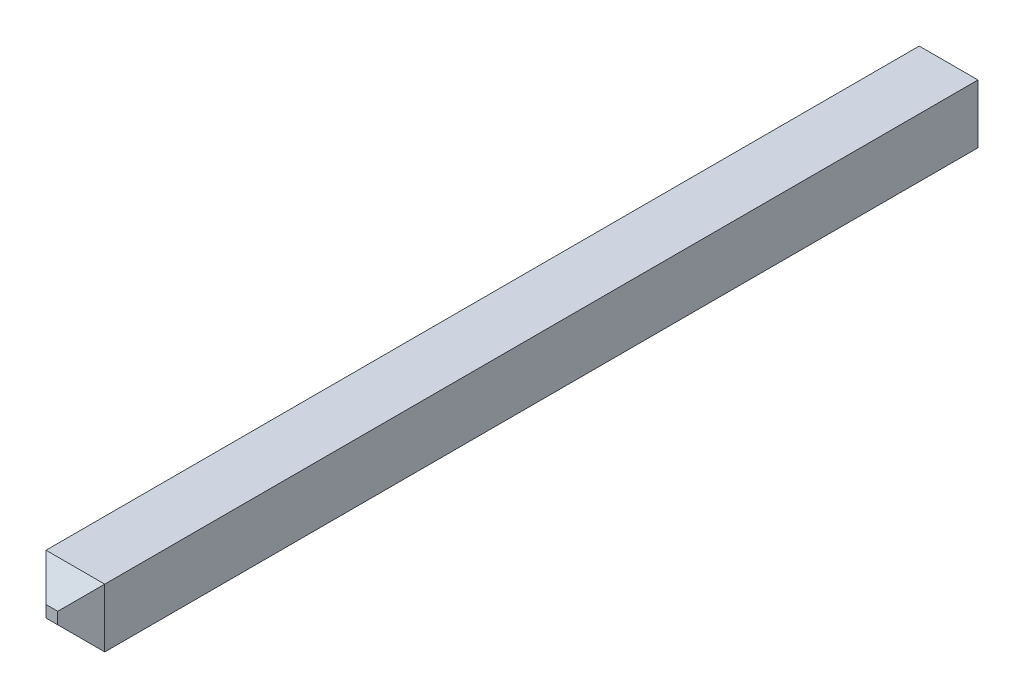
ISO-10303-21;
HEADER;
FILE_DESCRIPTION(('STEP AP214'),'2;1');
FILE_NAME('part.step','',(''),(''),'','','');
FILE_SCHEMA(('AUTOMOTIVE_DESIGN { 1 0 10303 214 1 1 1 1 }'));
ENDSEC;
DATA;
#1=APPLICATION_CONTEXT('core data for automotive mechanical design processes');
#2=APPLICATION_PROTOCOL_DEFINITION('international standard','automotive_design',2000,#1);
#3=PRODUCT_CONTEXT('',#1,'mechanical');
#4=PRODUCT('Part','Part','',(#3));
#5=PRODUCT_RELATED_PRODUCT_CATEGORY('part','',(#4));
#6=PRODUCT_DEFINITION_FORMATION('','',#4);
#7=PRODUCT_DEFINITION_CONTEXT('part definition',#1,'design');
#8=PRODUCT_DEFINITION('design','',#6,#7);
#9=PRODUCT_DEFINITION_SHAPE('','',#8);
#10=(LENGTH_UNIT() NAMED_UNIT(*) SI_UNIT(.MILLI.,.METRE.));
#11=(NAMED_UNIT(*) PLANE_ANGLE_UNIT() SI_UNIT($,.RADIAN.));
#12=(NAMED_UNIT(*) SI_UNIT($,.STERADIAN.) SOLID_ANGLE_UNIT());
#13=UNCERTAINTY_MEASURE_WITH_UNIT(LENGTH_MEASURE(1.E-05),#10,'distance_accuracy_value','');
#14=(GEOMETRIC_REPRESENTATION_CONTEXT(3) GLOBAL_UNCERTAINTY_ASSIGNED_CONTEXT((#13)) GLOBAL_UNIT_ASSIGNED_CONTEXT((#10,
#11,#12)) REPRESENTATION_CONTEXT('',''));
#15=CARTESIAN_POINT('',(0.,0.,0.));
#16=DIRECTION('',(0.,0.,1.));
#17=DIRECTION('',(1.,0.,0.));
#18=AXIS2_PLACEMENT_3D('',#15,#16,#17);
#19=CARTESIAN_POINT('',(0.731975872170932,-0.915257438330513,0.400189763779528));
#20=DIRECTION('',(0.,-0.707106781186544,-0.707106781186551));
#21=DIRECTION('',(0.,0.707106781186551,-0.707106781186544));
#22=AXIS2_PLACEMENT_3D('',#19,#20,#21);
#23=PLANE('',#22);
#24=DIRECTION('',(-1.,0.,0.));
#25=VECTOR('',#24,1.);
#26=CARTESIAN_POINT('',(0.712487683194554,-0.914666887149411,0.399599212598425));
#27=LINE('',#26,#25);
#28=CARTESIAN_POINT('',(0.712782958785105,-0.914666887149411,0.399599212598425));
#29=VERTEX_POINT('',#28);
#30=CARTESIAN_POINT('',(0.718688470596129,-0.914666887149411,0.399599212598425));
#31=VERTEX_POINT('',#30);
#32=EDGE_CURVE('E80',#29,#31,#27,.F.);
#33=ORIENTED_EDGE('',*,*,#32,.T.);
#34=DIRECTION('',(-0.577350269189628,-0.577350269189628,0.577350269189622));
#35=VECTOR('',#34,1.);
#36=CARTESIAN_POINT('',(0.730499494218177,-0.902855863527364,0.387788188976379));
#37=LINE('',#36,#35);
#38=CARTESIAN_POINT('',(0.730499494218176,-0.902855863527364,0.387788188976378));
#39=VERTEX_POINT('',#38);
#40=EDGE_CURVE('E20',#39,#31,#37,.T.);
#41=ORIENTED_EDGE('',*,*,#40,.F.);
#42=DIRECTION('',(1.,0.,0.));
#43=VECTOR('',#42,1.);
#44=CARTESIAN_POINT('',(0.699495557210302,-0.902855863527364,0.387788188976378));
#45=LINE('',#44,#43);
#46=CARTESIAN_POINT('',(0.700971935163058,-0.902855863527364,0.387788188976378));
#47=VERTEX_POINT('',#46);
#48=EDGE_CURVE('E107',#39,#47,#45,.F.);
#49=ORIENTED_EDGE('',*,*,#48,.T.);
#50=DIRECTION('',(-0.577350269189627,0.577350269189627,-0.577350269189624));
#51=VECTOR('',#50,1.);
#52=CARTESIAN_POINT('',(0.712782958785104,-0.914666887149411,0.399599212598426));
#53=LINE('',#52,#51);
#54=EDGE_CURVE('E86',#29,#47,#53,.T.);
#55=ORIENTED_EDGE('',*,*,#54,.F.);
#56=EDGE_LOOP('',(#33,#41,#49,#55));
#57=FACE_BOUND('',#56,.T.);
#58=ADVANCED_FACE('F17',(#57),#23,.F.);
#59=CARTESIAN_POINT('',(0.699495557210302,-0.902265312346261,-0.0505976377952755));
#60=DIRECTION('',(0.,0.707106781186552,-0.707106781186543));
#61=DIRECTION('',(0.,0.707106781186543,0.707106781186552));
#62=AXIS2_PLACEMENT_3D('',#59,#60,#61);
#63=PLANE('',#62);
#64=DIRECTION('',(-0.577350269189623,-0.577350269189623,-0.577350269189631));
#65=VECTOR('',#64,1.);
#66=CARTESIAN_POINT('',(0.730499494218176,-0.902855863527364,-0.0511881889763783));
#67=LINE('',#66,#65);
#68=CARTESIAN_POINT('',(0.730499494218176,-0.902855863527364,-0.0511881889763781));
#69=VERTEX_POINT('',#68);
#70=CARTESIAN_POINT('',(0.718688470596129,-0.914666887149411,-0.0629992125984255));
#71=VERTEX_POINT('',#70);
#72=EDGE_CURVE('E109',#69,#71,#67,.T.);
#73=ORIENTED_EDGE('',*,*,#72,.T.);
#74=DIRECTION('',(-1.,0.,0.));
#75=VECTOR('',#74,1.);
#76=CARTESIAN_POINT('',(0.712487683194554,-0.914666887149411,-0.0629992125984253));
#77=LINE('',#76,#75);
#78=CARTESIAN_POINT('',(0.712782958785105,-0.914666887149411,-0.0629992125984253));
#79=VERTEX_POINT('',#78);
#80=EDGE_CURVE('E114',#79,#71,#77,.F.);
#81=ORIENTED_EDGE('',*,*,#80,.F.);
#82=DIRECTION('',(-0.577350269189625,0.57735026918962,0.577350269189632));
#83=VECTOR('',#82,1.);
#84=CARTESIAN_POINT('',(0.712782958785105,-0.914666887149411,-0.062999212598425));
#85=LINE('',#84,#83);
#86=CARTESIAN_POINT('',(0.700971935163058,-0.902855863527364,-0.051188188976378));
#87=VERTEX_POINT('',#86);
#88=EDGE_CURVE('E117',#79,#87,#85,.T.);
#89=ORIENTED_EDGE('',*,*,#88,.T.);
#90=DIRECTION('',(1.,0.,0.));
#91=VECTOR('',#90,1.);
#92=CARTESIAN_POINT('',(0.699495557210302,-0.902855863527364,-0.0511881889763779));
#93=LINE('',#92,#91);
#94=EDGE_CURVE('E105',#87,#69,#93,.T.);
#95=ORIENTED_EDGE('',*,*,#94,.T.);
#96=EDGE_LOOP('',(#73,#81,#89,#95));
#97=FACE_BOUND('',#96,.T.);
#98=ADVANCED_FACE('F175',(#97),#63,.T.);
#99=CARTESIAN_POINT('',(0.718097919415027,-0.901379485574608,0.400189763779528));
#100=DIRECTION('',(0.707106781186544,0.,0.707106781186551));
#101=DIRECTION('',(0.707106781186551,0.,-0.707106781186544));
#102=AXIS2_PLACEMENT_3D('',#99,#100,#101);
#103=PLANE('',#102);
#104=DIRECTION('',(0.,1.,0.));
#105=VECTOR('',#104,1.);
#106=CARTESIAN_POINT('',(0.730499494218176,-0.933859800535238,0.387788188976378));
#107=LINE('',#106,#105);
#108=CARTESIAN_POINT('',(0.730499494218176,-0.932383422582482,0.387788188976378));
#109=VERTEX_POINT('',#108);
#110=EDGE_CURVE('E94',#39,#109,#107,.F.);
#111=ORIENTED_EDGE('',*,*,#110,.F.);
#112=ORIENTED_EDGE('',*,*,#40,.T.);
#113=DIRECTION('',(0.,1.,0.));
#114=VECTOR('',#113,1.);
#115=CARTESIAN_POINT('',(0.718688470596129,-0.91437161155886,0.399599212598425));
#116=LINE('',#115,#114);
#117=CARTESIAN_POINT('',(0.718688470596129,-0.920572398960434,0.399599212598425));
#118=VERTEX_POINT('',#117);
#119=EDGE_CURVE('E88',#31,#118,#116,.F.);
#120=ORIENTED_EDGE('',*,*,#119,.T.);
#121=DIRECTION('',(-0.577350269189606,0.577350269189638,0.577350269189633));
#122=VECTOR('',#121,1.);
#123=CARTESIAN_POINT('',(0.730499494218176,-0.932383422582482,0.387788188976378));
#124=LINE('',#123,#122);
#125=EDGE_CURVE('E131',#109,#118,#124,.T.);
#126=ORIENTED_EDGE('',*,*,#125,.F.);
#127=EDGE_LOOP('',(#111,#112,#120,#126));
#128=FACE_BOUND('',#127,.T.);
#129=ADVANCED_FACE('F91',(#128),#103,.T.);
#130=CARTESIAN_POINT('',(0.712487683194554,-0.91437161155886,0.399599212598425));
#131=DIRECTION('',(0.,0.,-1.));
#132=DIRECTION('',(-1.,0.,0.));
#133=AXIS2_PLACEMENT_3D('',#130,#131,#132);
#134=PLANE('',#133);
#135=DIRECTION('',(1.,0.,0.));
#136=VECTOR('',#135,1.);
#137=CARTESIAN_POINT('',(0.731975872170932,-0.920572398960435,0.399599212598426));
#138=LINE('',#137,#136);
#139=CARTESIAN_POINT('',(0.712782958785105,-0.920572398960434,0.399599212598425));
#140=VERTEX_POINT('',#139);
#141=EDGE_CURVE('E98',#118,#140,#138,.F.);
#142=ORIENTED_EDGE('',*,*,#141,.F.);
#143=ORIENTED_EDGE('',*,*,#119,.F.);
#144=ORIENTED_EDGE('',*,*,#32,.F.);
#145=DIRECTION('',(0.,1.,0.));
#146=VECTOR('',#145,1.);
#147=CARTESIAN_POINT('',(0.712782958785104,-0.933859800535238,0.399599212598426));
#148=LINE('',#147,#146);
#149=EDGE_CURVE('E100',#140,#29,#148,.T.);
#150=ORIENTED_EDGE('',*,*,#149,.F.);
#151=EDGE_LOOP('',(#142,#143,#144,#150));
#152=FACE_BOUND('',#151,.T.);
#153=ADVANCED_FACE('F96',(#152),#134,.F.);
#154=CARTESIAN_POINT('',(0.713373509966207,-0.933859800535238,0.400189763779528));
#155=DIRECTION('',(-0.707106781186544,0.,0.707106781186551));
#156=DIRECTION('',(0.707106781186551,0.,0.707106781186544));
#157=AXIS2_PLACEMENT_3D('',#154,#155,#156);
#158=PLANE('',#157);
#159=ORIENTED_EDGE('',*,*,#149,.T.);
#160=ORIENTED_EDGE('',*,*,#54,.T.);
#161=DIRECTION('',(0.,1.,0.));
#162=VECTOR('',#161,1.);
#163=CARTESIAN_POINT('',(0.700971935163058,-0.901379485574608,0.387788188976378));
#164=LINE('',#163,#162);
#165=CARTESIAN_POINT('',(0.700971935163058,-0.932383422582482,0.387788188976378));
#166=VERTEX_POINT('',#165);
#167=EDGE_CURVE('E134',#166,#47,#164,.T.);
#168=ORIENTED_EDGE('',*,*,#167,.F.);
#169=DIRECTION('',(-0.57735026918961,-0.577350269189636,-0.577350269189631));
#170=VECTOR('',#169,1.);
#171=CARTESIAN_POINT('',(0.712782958785105,-0.920572398960435,0.399599212598426));
#172=LINE('',#171,#170);
#173=EDGE_CURVE('E128',#140,#166,#172,.T.);
#174=ORIENTED_EDGE('',*,*,#173,.F.);
#175=EDGE_LOOP('',(#159,#160,#168,#174));
#176=FACE_BOUND('',#175,.T.);
#177=ADVANCED_FACE('F184',(#176),#158,.T.);
#178=CARTESIAN_POINT('',(0.699495557210302,-0.902855863527364,0.152158267716535));
#179=DIRECTION('',(0.,-1.,0.));
#180=DIRECTION('',(0.,0.,-1.));
#181=AXIS2_PLACEMENT_3D('',#178,#179,#180);
#182=PLANE('',#181);
#183=ORIENTED_EDGE('',*,*,#48,.F.);
#184=DIRECTION('',(0.,0.,-1.));
#185=VECTOR('',#184,1.);
#186=CARTESIAN_POINT('',(0.730499494218176,-0.902855863527364,0.152158267716535));
#187=LINE('',#186,#185);
#188=EDGE_CURVE('E122',#69,#39,#187,.F.);
#189=ORIENTED_EDGE('',*,*,#188,.F.);
#190=ORIENTED_EDGE('',*,*,#94,.F.);
#191=DIRECTION('',(0.,0.,1.));
#192=VECTOR('',#191,1.);
#193=CARTESIAN_POINT('',(0.700971935163058,-0.902855863527364,0.152158267716535));
#194=LINE('',#193,#192);
#195=EDGE_CURVE('E137',#47,#87,#194,.F.);
#196=ORIENTED_EDGE('',*,*,#195,.F.);
#197=EDGE_LOOP('',(#183,#189,#190,#196));
#198=FACE_BOUND('',#197,.T.);
#199=ADVANCED_FACE('F186',(#198),#182,.F.);
#200=CARTESIAN_POINT('',(0.731090045399279,-0.933859800535238,-0.0505976377952755));
#201=DIRECTION('',(-0.707106781186552,0.,0.707106781186543));
#202=DIRECTION('',(0.707106781186543,0.,0.707106781186552));
#203=AXIS2_PLACEMENT_3D('',#200,#201,#202);
#204=PLANE('',#203);
#205=DIRECTION('',(-0.577350269189602,0.577350269189634,-0.577350269189642));
#206=VECTOR('',#205,1.);
#207=CARTESIAN_POINT('',(0.730499494218176,-0.932383422582482,-0.0511881889763777));
#208=LINE('',#207,#206);
#209=CARTESIAN_POINT('',(0.730499494218176,-0.932383422582482,-0.0511881889763781));
#210=VERTEX_POINT('',#209);
#211=CARTESIAN_POINT('',(0.718688470596129,-0.920572398960434,-0.0629992125984255));
#212=VERTEX_POINT('',#211);
#213=EDGE_CURVE('E142',#210,#212,#208,.T.);
#214=ORIENTED_EDGE('',*,*,#213,.T.);
#215=DIRECTION('',(0.,1.,0.));
#216=VECTOR('',#215,1.);
#217=CARTESIAN_POINT('',(0.718688470596129,-0.91437161155886,-0.0629992125984253));
#218=LINE('',#217,#216);
#219=EDGE_CURVE('E111',#71,#212,#218,.F.);
#220=ORIENTED_EDGE('',*,*,#219,.F.);
#221=ORIENTED_EDGE('',*,*,#72,.F.);
#222=DIRECTION('',(0.,1.,0.));
#223=VECTOR('',#222,1.);
#224=CARTESIAN_POINT('',(0.730499494218176,-0.933859800535238,-0.0511881889763779));
#225=LINE('',#224,#223);
#226=EDGE_CURVE('E125',#210,#69,#225,.T.);
#227=ORIENTED_EDGE('',*,*,#226,.F.);
#228=EDGE_LOOP('',(#214,#220,#221,#227));
#229=FACE_BOUND('',#228,.T.);
#230=ADVANCED_FACE('F169',(#229),#204,.F.);
#231=CARTESIAN_POINT('',(0.712487683194554,-0.91437161155886,-0.0629992125984253));
#232=DIRECTION('',(0.,0.,-1.));
#233=DIRECTION('',(-1.,0.,0.));
#234=AXIS2_PLACEMENT_3D('',#231,#232,#233);
#235=PLANE('',#234);
#236=DIRECTION('',(0.,1.,0.));
#237=VECTOR('',#236,1.);
#238=CARTESIAN_POINT('',(0.712782958785105,-0.901379485574608,-0.062999212598425));
#239=LINE('',#238,#237);
#240=CARTESIAN_POINT('',(0.712782958785105,-0.920572398960434,-0.0629992125984253));
#241=VERTEX_POINT('',#240);
#242=EDGE_CURVE('E119',#241,#79,#239,.T.);
#243=ORIENTED_EDGE('',*,*,#242,.T.);
#244=ORIENTED_EDGE('',*,*,#80,.T.);
#245=ORIENTED_EDGE('',*,*,#219,.T.);
#246=DIRECTION('',(1.,0.,0.));
#247=VECTOR('',#246,1.);
#248=CARTESIAN_POINT('',(0.699495557210302,-0.920572398960434,-0.0629992125984255));
#249=LINE('',#248,#247);
#250=EDGE_CURVE('E144',#212,#241,#249,.F.);
#251=ORIENTED_EDGE('',*,*,#250,.T.);
#252=EDGE_LOOP('',(#243,#244,#245,#251));
#253=FACE_BOUND('',#252,.T.);
#254=ADVANCED_FACE('F173',(#253),#235,.T.);
#255=CARTESIAN_POINT('',(0.700381383981956,-0.901379485574608,-0.0505976377952755));
#256=DIRECTION('',(0.707106781186552,0.,0.707106781186543));
#257=DIRECTION('',(0.707106781186543,0.,-0.707106781186552));
#258=AXIS2_PLACEMENT_3D('',#255,#256,#257);
#259=PLANE('',#258);
#260=DIRECTION('',(-0.577350269189605,-0.577350269189632,0.57735026918964));
#261=VECTOR('',#260,1.);
#262=CARTESIAN_POINT('',(0.712782958785105,-0.920572398960434,-0.0629992125984255));
#263=LINE('',#262,#261);
#264=CARTESIAN_POINT('',(0.700971935163058,-0.932383422582482,-0.0511881889763778));
#265=VERTEX_POINT('',#264);
#266=EDGE_CURVE('E35',#241,#265,#263,.T.);
#267=ORIENTED_EDGE('',*,*,#266,.T.);
#268=DIRECTION('',(0.,1.,0.));
#269=VECTOR('',#268,1.);
#270=CARTESIAN_POINT('',(0.700971935163058,-0.901379485574608,-0.0511881889763779));
#271=LINE('',#270,#269);
#272=EDGE_CURVE('E140',#87,#265,#271,.F.);
#273=ORIENTED_EDGE('',*,*,#272,.F.);
#274=ORIENTED_EDGE('',*,*,#88,.F.);
#275=ORIENTED_EDGE('',*,*,#242,.F.);
#276=EDGE_LOOP('',(#267,#273,#274,#275));
#277=FACE_BOUND('',#276,.T.);
#278=ADVANCED_FACE('F209',(#277),#259,.F.);
#279=CARTESIAN_POINT('',(0.730499494218176,-0.933859800535238,0.152158267716535));
#280=DIRECTION('',(1.,0.,0.));
#281=DIRECTION('',(0.,0.,-1.));
#282=AXIS2_PLACEMENT_3D('',#279,#280,#281);
#283=PLANE('',#282);
#284=DIRECTION('',(0.,0.,-1.));
#285=VECTOR('',#284,1.);
#286=CARTESIAN_POINT('',(0.730499494218176,-0.932383422582482,0.152158267716535));
#287=LINE('',#286,#285);
#288=EDGE_CURVE('E147',#210,#109,#287,.F.);
#289=ORIENTED_EDGE('',*,*,#288,.F.);
#290=ORIENTED_EDGE('',*,*,#226,.T.);
#291=ORIENTED_EDGE('',*,*,#188,.T.);
#292=ORIENTED_EDGE('',*,*,#110,.T.);
#293=EDGE_LOOP('',(#289,#290,#291,#292));
#294=FACE_BOUND('',#293,.T.);
#295=ADVANCED_FACE('F179',(#294),#283,.T.);
#296=CARTESIAN_POINT('',(0.731975872170932,-0.919981847779332,0.400189763779528));
#297=DIRECTION('',(0.,-0.707106781186544,0.707106781186551));
#298=DIRECTION('',(0.,-0.707106781186551,-0.707106781186544));
#299=AXIS2_PLACEMENT_3D('',#296,#297,#298);
#300=PLANE('',#299);
#301=ORIENTED_EDGE('',*,*,#125,.T.);
#302=ORIENTED_EDGE('',*,*,#141,.T.);
#303=ORIENTED_EDGE('',*,*,#173,.T.);
#304=DIRECTION('',(1.,0.,0.));
#305=VECTOR('',#304,1.);
#306=CARTESIAN_POINT('',(0.699495557210302,-0.932383422582482,0.387788188976378));
#307=LINE('',#306,#305);
#308=EDGE_CURVE('E150',#109,#166,#307,.F.);
#309=ORIENTED_EDGE('',*,*,#308,.F.);
#310=EDGE_LOOP('',(#301,#302,#303,#309));
#311=FACE_BOUND('',#310,.T.);
#312=ADVANCED_FACE('F181',(#311),#300,.T.);
#313=CARTESIAN_POINT('',(0.700971935163058,-0.901379485574608,0.152158267716535));
#314=DIRECTION('',(-1.,0.,0.));
#315=DIRECTION('',(0.,0.,1.));
#316=AXIS2_PLACEMENT_3D('',#313,#314,#315);
#317=PLANE('',#316);
#318=ORIENTED_EDGE('',*,*,#195,.T.);
#319=ORIENTED_EDGE('',*,*,#272,.T.);
#320=DIRECTION('',(0.,0.,-1.));
#321=VECTOR('',#320,1.);
#322=CARTESIAN_POINT('',(0.700971935163058,-0.932383422582482,0.152158267716535));
#323=LINE('',#322,#321);
#324=EDGE_CURVE('E26',#166,#265,#323,.T.);
#325=ORIENTED_EDGE('',*,*,#324,.F.);
#326=ORIENTED_EDGE('',*,*,#167,.T.);
#327=EDGE_LOOP('',(#318,#319,#325,#326));
#328=FACE_BOUND('',#327,.T.);
#329=ADVANCED_FACE('F160',(#328),#317,.T.);
#330=CARTESIAN_POINT('',(0.699495557210302,-0.932973973763584,-0.0505976377952755));
#331=DIRECTION('',(0.,0.707106781186552,0.707106781186543));
#332=DIRECTION('',(0.,-0.707106781186543,0.707106781186552));
#333=AXIS2_PLACEMENT_3D('',#330,#331,#332);
#334=PLANE('',#333);
#335=ORIENTED_EDGE('',*,*,#250,.F.);
#336=ORIENTED_EDGE('',*,*,#213,.F.);
#337=DIRECTION('',(1.,0.,0.));
#338=VECTOR('',#337,1.);
#339=CARTESIAN_POINT('',(0.699495557210302,-0.932383422582482,-0.0511881889763779));
#340=LINE('',#339,#338);
#341=EDGE_CURVE('E11',#265,#210,#340,.T.);
#342=ORIENTED_EDGE('',*,*,#341,.F.);
#343=ORIENTED_EDGE('',*,*,#266,.F.);
#344=EDGE_LOOP('',(#335,#336,#342,#343));
#345=FACE_BOUND('',#344,.T.);
#346=ADVANCED_FACE('F166',(#345),#334,.F.);
#347=CARTESIAN_POINT('',(0.699495557210302,-0.932383422582482,0.152158267716535));
#348=DIRECTION('',(0.,-1.,0.));
#349=DIRECTION('',(0.,0.,-1.));
#350=AXIS2_PLACEMENT_3D('',#347,#348,#349);
#351=PLANE('',#350);
#352=ORIENTED_EDGE('',*,*,#324,.T.);
#353=ORIENTED_EDGE('',*,*,#341,.T.);
#354=ORIENTED_EDGE('',*,*,#288,.T.);
#355=ORIENTED_EDGE('',*,*,#308,.T.);
#356=EDGE_LOOP('',(#352,#353,#354,#355));
#357=FACE_BOUND('',#356,.T.);
#358=ADVANCED_FACE('F156',(#357),#351,.T.);
#359=CLOSED_SHELL('',(#58,#98,#129,#153,#177,#199,#230,#254,#278,#295,#312,#329,#346,#358));
#360=MANIFOLD_SOLID_BREP('B1',#359);
#361=ADVANCED_BREP_SHAPE_REPRESENTATION('',(#18,#360),#14);
#362=SHAPE_DEFINITION_REPRESENTATION(#9,#361);
ENDSEC;
END-ISO-10303-21;
